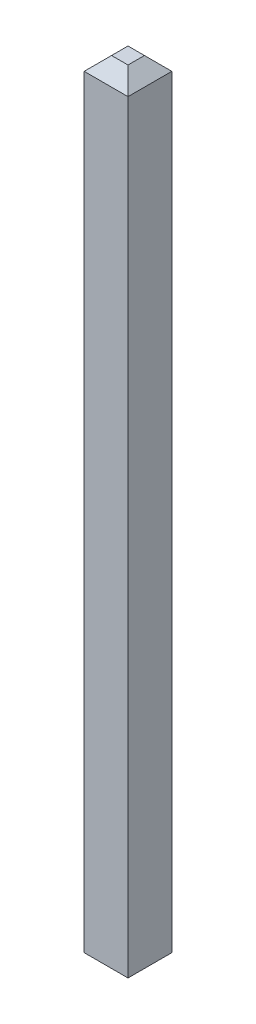
ISO-10303-21;
HEADER;
FILE_DESCRIPTION(('STEP AP214'),'2;1');
FILE_NAME('part.step','',(''),(''),'','','');
FILE_SCHEMA(('AUTOMOTIVE_DESIGN { 1 0 10303 214 1 1 1 1 }'));
ENDSEC;
DATA;
#1=APPLICATION_CONTEXT('core data for automotive mechanical design processes');
#2=APPLICATION_PROTOCOL_DEFINITION('international standard','automotive_design',2000,#1);
#3=PRODUCT_CONTEXT('',#1,'mechanical');
#4=PRODUCT('Part','Part','',(#3));
#5=PRODUCT_RELATED_PRODUCT_CATEGORY('part','',(#4));
#6=PRODUCT_DEFINITION_FORMATION('','',#4);
#7=PRODUCT_DEFINITION_CONTEXT('part definition',#1,'design');
#8=PRODUCT_DEFINITION('design','',#6,#7);
#9=PRODUCT_DEFINITION_SHAPE('','',#8);
#10=(LENGTH_UNIT() NAMED_UNIT(*) SI_UNIT(.MILLI.,.METRE.));
#11=(NAMED_UNIT(*) PLANE_ANGLE_UNIT() SI_UNIT($,.RADIAN.));
#12=(NAMED_UNIT(*) SI_UNIT($,.STERADIAN.) SOLID_ANGLE_UNIT());
#13=UNCERTAINTY_MEASURE_WITH_UNIT(LENGTH_MEASURE(1.E-05),#10,'distance_accuracy_value','');
#14=(GEOMETRIC_REPRESENTATION_CONTEXT(3) GLOBAL_UNCERTAINTY_ASSIGNED_CONTEXT((#13)) GLOBAL_UNIT_ASSIGNED_CONTEXT((#10,
#11,#12)) REPRESENTATION_CONTEXT('',''));
#15=CARTESIAN_POINT('',(0.,0.,0.));
#16=DIRECTION('',(0.,0.,1.));
#17=DIRECTION('',(1.,0.,0.));
#18=AXIS2_PLACEMENT_3D('',#15,#16,#17);
#19=CARTESIAN_POINT('',(-3.69,-4.27,-0.32));
#20=DIRECTION('',(-0.707106781186548,0.707106781186548,0.));
#21=DIRECTION('',(-0.707106781186548,-0.707106781186548,0.));
#22=AXIS2_PLACEMENT_3D('',#19,#20,#21);
#23=PLANE('',#22);
#24=DIRECTION('',(0.,0.,1.));
#25=VECTOR('',#24,1.);
#26=CARTESIAN_POINT('',(-3.48999999999999,-4.07,-0.32));
#27=LINE('',#26,#25);
#28=CARTESIAN_POINT('',(-3.49,-4.07,-0.32));
#29=VERTEX_POINT('',#28);
#30=CARTESIAN_POINT('',(-3.49,-4.07,0.32));
#31=VERTEX_POINT('',#30);
#32=EDGE_CURVE('E119',#29,#31,#27,.T.);
#33=ORIENTED_EDGE('',*,*,#32,.T.);
#34=DIRECTION('',(-0.577350269189626,-0.577350269189626,-0.577350269189626));
#35=VECTOR('',#34,1.);
#36=CARTESIAN_POINT('',(-3.49,-4.07,0.32));
#37=LINE('',#36,#35);
#38=CARTESIAN_POINT('',(-3.69,-4.27,0.12));
#39=VERTEX_POINT('',#38);
#40=EDGE_CURVE('E95',#31,#39,#37,.T.);
#41=ORIENTED_EDGE('',*,*,#40,.T.);
#42=DIRECTION('',(0.,0.,1.));
#43=VECTOR('',#42,1.);
#44=CARTESIAN_POINT('',(-3.69,-4.27,-0.32));
#45=LINE('',#44,#43);
#46=CARTESIAN_POINT('',(-3.69,-4.27,-0.12));
#47=VERTEX_POINT('',#46);
#48=EDGE_CURVE('E20',#39,#47,#45,.F.);
#49=ORIENTED_EDGE('',*,*,#48,.T.);
#50=DIRECTION('',(-0.577350269189626,-0.577350269189626,0.577350269189625));
#51=VECTOR('',#50,1.);
#52=CARTESIAN_POINT('',(-3.49,-4.07,-0.32));
#53=LINE('',#52,#51);
#54=EDGE_CURVE('E84',#29,#47,#53,.T.);
#55=ORIENTED_EDGE('',*,*,#54,.F.);
#56=EDGE_LOOP('',(#33,#41,#49,#55));
#57=FACE_BOUND('',#56,.T.);
#58=ADVANCED_FACE('F17',(#57),#23,.F.);
#59=CARTESIAN_POINT('',(-3.49,7.07,-0.32));
#60=DIRECTION('',(-0.707106781186548,-0.707106781186548,0.));
#61=DIRECTION('',(0.707106781186548,-0.707106781186548,0.));
#62=AXIS2_PLACEMENT_3D('',#59,#60,#61);
#63=PLANE('',#62);
#64=DIRECTION('',(0.,0.,1.));
#65=VECTOR('',#64,1.);
#66=CARTESIAN_POINT('',(-3.49,7.07,-0.32));
#67=LINE('',#66,#65);
#68=CARTESIAN_POINT('',(-3.49,7.07,0.32));
#69=VERTEX_POINT('',#68);
#70=CARTESIAN_POINT('',(-3.49,7.07,-0.32));
#71=VERTEX_POINT('',#70);
#72=EDGE_CURVE('E121',#69,#71,#67,.F.);
#73=ORIENTED_EDGE('',*,*,#72,.T.);
#74=DIRECTION('',(0.577350269189627,-0.577350269189627,-0.577350269189624));
#75=VECTOR('',#74,1.);
#76=CARTESIAN_POINT('',(-3.69,7.27,-0.12));
#77=LINE('',#76,#75);
#78=CARTESIAN_POINT('',(-3.69,7.27,-0.12));
#79=VERTEX_POINT('',#78);
#80=EDGE_CURVE('E78',#79,#71,#77,.T.);
#81=ORIENTED_EDGE('',*,*,#80,.F.);
#82=DIRECTION('',(0.,0.,1.));
#83=VECTOR('',#82,1.);
#84=CARTESIAN_POINT('',(-3.69,7.27,-0.32));
#85=LINE('',#84,#83);
#86=CARTESIAN_POINT('',(-3.69,7.27,0.12));
#87=VERTEX_POINT('',#86);
#88=EDGE_CURVE('E108',#79,#87,#85,.T.);
#89=ORIENTED_EDGE('',*,*,#88,.T.);
#90=DIRECTION('',(0.577350269189627,-0.577350269189627,0.577350269189624));
#91=VECTOR('',#90,1.);
#92=CARTESIAN_POINT('',(-3.69,7.27,0.119999999999999));
#93=LINE('',#92,#91);
#94=EDGE_CURVE('E116',#87,#69,#93,.T.);
#95=ORIENTED_EDGE('',*,*,#94,.T.);
#96=EDGE_LOOP('',(#73,#81,#89,#95));
#97=FACE_BOUND('',#96,.T.);
#98=ADVANCED_FACE('F214',(#97),#63,.F.);
#99=CARTESIAN_POINT('',(-3.49,-4.27,-0.32));
#100=DIRECTION('',(0.,1.,0.));
#101=DIRECTION('',(0.,0.,1.));
#102=AXIS2_PLACEMENT_3D('',#99,#100,#101);
#103=PLANE('',#102);
#104=DIRECTION('',(1.,0.,0.));
#105=VECTOR('',#104,1.);
#106=CARTESIAN_POINT('',(-3.49,-4.27,0.12));
#107=LINE('',#106,#105);
#108=CARTESIAN_POINT('',(-3.93,-4.27,0.12));
#109=VERTEX_POINT('',#108);
#110=EDGE_CURVE('E110',#39,#109,#107,.F.);
#111=ORIENTED_EDGE('',*,*,#110,.T.);
#112=DIRECTION('',(0.,0.,1.));
#113=VECTOR('',#112,1.);
#114=CARTESIAN_POINT('',(-3.93,-4.27,-0.32));
#115=LINE('',#114,#113);
#116=CARTESIAN_POINT('',(-3.93,-4.27,-0.12));
#117=VERTEX_POINT('',#116);
#118=EDGE_CURVE('E101',#109,#117,#115,.F.);
#119=ORIENTED_EDGE('',*,*,#118,.T.);
#120=DIRECTION('',(1.,0.,0.));
#121=VECTOR('',#120,1.);
#122=CARTESIAN_POINT('',(-3.81,-4.27,-0.12));
#123=LINE('',#122,#121);
#124=EDGE_CURVE('E89',#47,#117,#123,.F.);
#125=ORIENTED_EDGE('',*,*,#124,.F.);
#126=ORIENTED_EDGE('',*,*,#48,.F.);
#127=EDGE_LOOP('',(#111,#119,#125,#126));
#128=FACE_BOUND('',#127,.T.);
#129=ADVANCED_FACE('F99',(#128),#103,.F.);
#130=CARTESIAN_POINT('',(-3.81,-4.07,-0.32));
#131=DIRECTION('',(0.,-0.707106781186548,-0.707106781186548));
#132=DIRECTION('',(0.,0.707106781186548,-0.707106781186548));
#133=AXIS2_PLACEMENT_3D('',#130,#131,#132);
#134=PLANE('',#133);
#135=ORIENTED_EDGE('',*,*,#54,.T.);
#136=ORIENTED_EDGE('',*,*,#124,.T.);
#137=DIRECTION('',(-0.577350269189625,0.577350269189625,-0.577350269189627));
#138=VECTOR('',#137,1.);
#139=CARTESIAN_POINT('',(-3.93,-4.27,-0.12));
#140=LINE('',#139,#138);
#141=CARTESIAN_POINT('',(-4.13,-4.07,-0.32));
#142=VERTEX_POINT('',#141);
#143=EDGE_CURVE('E127',#117,#142,#140,.T.);
#144=ORIENTED_EDGE('',*,*,#143,.T.);
#145=DIRECTION('',(-1.,0.,0.));
#146=VECTOR('',#145,1.);
#147=CARTESIAN_POINT('',(-3.81,-4.07,-0.320000000000001));
#148=LINE('',#147,#146);
#149=EDGE_CURVE('E91',#29,#142,#148,.T.);
#150=ORIENTED_EDGE('',*,*,#149,.F.);
#151=EDGE_LOOP('',(#135,#136,#144,#150));
#152=FACE_BOUND('',#151,.T.);
#153=ADVANCED_FACE('F86',(#152),#134,.T.);
#154=CARTESIAN_POINT('',(-3.81,7.07,-0.32));
#155=DIRECTION('',(0.,0.707106781186548,-0.707106781186548));
#156=DIRECTION('',(0.,0.707106781186548,0.707106781186548));
#157=AXIS2_PLACEMENT_3D('',#154,#155,#156);
#158=PLANE('',#157);
#159=ORIENTED_EDGE('',*,*,#80,.T.);
#160=DIRECTION('',(-1.,0.,0.));
#161=VECTOR('',#160,1.);
#162=CARTESIAN_POINT('',(-3.81,7.07,-0.319999999999999));
#163=LINE('',#162,#161);
#164=CARTESIAN_POINT('',(-4.13,7.07,-0.32));
#165=VERTEX_POINT('',#164);
#166=EDGE_CURVE('E129',#165,#71,#163,.F.);
#167=ORIENTED_EDGE('',*,*,#166,.F.);
#168=DIRECTION('',(0.577350269189625,0.577350269189625,0.577350269189627));
#169=VECTOR('',#168,1.);
#170=CARTESIAN_POINT('',(-4.13,7.07,-0.32));
#171=LINE('',#170,#169);
#172=CARTESIAN_POINT('',(-3.93,7.27,-0.120000000000001));
#173=VERTEX_POINT('',#172);
#174=EDGE_CURVE('E136',#165,#173,#171,.T.);
#175=ORIENTED_EDGE('',*,*,#174,.T.);
#176=DIRECTION('',(1.,0.,0.));
#177=VECTOR('',#176,1.);
#178=CARTESIAN_POINT('',(-4.13,7.27,-0.12));
#179=LINE('',#178,#177);
#180=EDGE_CURVE('E103',#173,#79,#179,.T.);
#181=ORIENTED_EDGE('',*,*,#180,.T.);
#182=EDGE_LOOP('',(#159,#167,#175,#181));
#183=FACE_BOUND('',#182,.T.);
#184=ADVANCED_FACE('F206',(#183),#158,.T.);
#185=CARTESIAN_POINT('',(-4.13,7.27,-0.32));
#186=DIRECTION('',(0.,-1.,0.));
#187=DIRECTION('',(1.,0.,0.));
#188=AXIS2_PLACEMENT_3D('',#185,#186,#187);
#189=PLANE('',#188);
#190=ORIENTED_EDGE('',*,*,#180,.F.);
#191=DIRECTION('',(0.,0.,1.));
#192=VECTOR('',#191,1.);
#193=CARTESIAN_POINT('',(-3.93,7.27,-0.32));
#194=LINE('',#193,#192);
#195=CARTESIAN_POINT('',(-3.93,7.27,0.12));
#196=VERTEX_POINT('',#195);
#197=EDGE_CURVE('E139',#173,#196,#194,.T.);
#198=ORIENTED_EDGE('',*,*,#197,.T.);
#199=DIRECTION('',(1.,0.,0.));
#200=VECTOR('',#199,1.);
#201=CARTESIAN_POINT('',(-4.13,7.27,0.12));
#202=LINE('',#201,#200);
#203=EDGE_CURVE('E113',#196,#87,#202,.T.);
#204=ORIENTED_EDGE('',*,*,#203,.T.);
#205=ORIENTED_EDGE('',*,*,#88,.F.);
#206=EDGE_LOOP('',(#190,#198,#204,#205));
#207=FACE_BOUND('',#206,.T.);
#208=ADVANCED_FACE('F203',(#207),#189,.F.);
#209=CARTESIAN_POINT('',(-3.49,-4.27,0.12));
#210=DIRECTION('',(0.,0.707106781186548,-0.707106781186548));
#211=DIRECTION('',(0.,0.707106781186548,0.707106781186548));
#212=AXIS2_PLACEMENT_3D('',#209,#210,#211);
#213=PLANE('',#212);
#214=DIRECTION('',(-1.,0.,0.));
#215=VECTOR('',#214,1.);
#216=CARTESIAN_POINT('',(-3.81,-4.07,0.319999999999999));
#217=LINE('',#216,#215);
#218=CARTESIAN_POINT('',(-4.13,-4.07,0.32));
#219=VERTEX_POINT('',#218);
#220=EDGE_CURVE('E144',#31,#219,#217,.T.);
#221=ORIENTED_EDGE('',*,*,#220,.T.);
#222=DIRECTION('',(0.577350269189625,-0.577350269189625,-0.577350269189627));
#223=VECTOR('',#222,1.);
#224=CARTESIAN_POINT('',(-4.13,-4.07,0.32));
#225=LINE('',#224,#223);
#226=EDGE_CURVE('E123',#219,#109,#225,.T.);
#227=ORIENTED_EDGE('',*,*,#226,.T.);
#228=ORIENTED_EDGE('',*,*,#110,.F.);
#229=ORIENTED_EDGE('',*,*,#40,.F.);
#230=EDGE_LOOP('',(#221,#227,#228,#229));
#231=FACE_BOUND('',#230,.T.);
#232=ADVANCED_FACE('F176',(#231),#213,.F.);
#233=CARTESIAN_POINT('',(-4.13,7.27,0.12));
#234=DIRECTION('',(0.,-0.707106781186548,-0.707106781186548));
#235=DIRECTION('',(0.,0.707106781186548,-0.707106781186548));
#236=AXIS2_PLACEMENT_3D('',#233,#234,#235);
#237=PLANE('',#236);
#238=ORIENTED_EDGE('',*,*,#203,.F.);
#239=DIRECTION('',(-0.577350269189625,-0.577350269189625,0.577350269189627));
#240=VECTOR('',#239,1.);
#241=CARTESIAN_POINT('',(-3.93,7.27,0.12));
#242=LINE('',#241,#240);
#243=CARTESIAN_POINT('',(-4.13,7.07,0.32));
#244=VERTEX_POINT('',#243);
#245=EDGE_CURVE('E142',#196,#244,#242,.T.);
#246=ORIENTED_EDGE('',*,*,#245,.T.);
#247=DIRECTION('',(-1.,0.,0.));
#248=VECTOR('',#247,1.);
#249=CARTESIAN_POINT('',(-3.81,7.07,0.320000000000001));
#250=LINE('',#249,#248);
#251=EDGE_CURVE('E34',#244,#69,#250,.F.);
#252=ORIENTED_EDGE('',*,*,#251,.T.);
#253=ORIENTED_EDGE('',*,*,#94,.F.);
#254=EDGE_LOOP('',(#238,#246,#252,#253));
#255=FACE_BOUND('',#254,.T.);
#256=ADVANCED_FACE('F196',(#255),#237,.F.);
#257=CARTESIAN_POINT('',(-3.49,7.27,-0.32));
#258=DIRECTION('',(-1.,0.,0.));
#259=DIRECTION('',(0.,-1.,0.));
#260=AXIS2_PLACEMENT_3D('',#257,#258,#259);
#261=PLANE('',#260);
#262=ORIENTED_EDGE('',*,*,#72,.F.);
#263=DIRECTION('',(0.,1.,0.));
#264=VECTOR('',#263,1.);
#265=CARTESIAN_POINT('',(-3.49,1.5,0.32));
#266=LINE('',#265,#264);
#267=EDGE_CURVE('E148',#69,#31,#266,.F.);
#268=ORIENTED_EDGE('',*,*,#267,.T.);
#269=ORIENTED_EDGE('',*,*,#32,.F.);
#270=DIRECTION('',(0.,1.,0.));
#271=VECTOR('',#270,1.);
#272=CARTESIAN_POINT('',(-3.49,1.5,-0.32));
#273=LINE('',#272,#271);
#274=EDGE_CURVE('E132',#71,#29,#273,.F.);
#275=ORIENTED_EDGE('',*,*,#274,.F.);
#276=EDGE_LOOP('',(#262,#268,#269,#275));
#277=FACE_BOUND('',#276,.T.);
#278=ADVANCED_FACE('F193',(#277),#261,.F.);
#279=CARTESIAN_POINT('',(-4.13,-4.07,-0.32));
#280=DIRECTION('',(0.707106781186548,0.707106781186548,0.));
#281=DIRECTION('',(-0.707106781186548,0.707106781186548,0.));
#282=AXIS2_PLACEMENT_3D('',#279,#280,#281);
#283=PLANE('',#282);
#284=ORIENTED_EDGE('',*,*,#118,.F.);
#285=ORIENTED_EDGE('',*,*,#226,.F.);
#286=DIRECTION('',(0.,0.,-1.));
#287=VECTOR('',#286,1.);
#288=CARTESIAN_POINT('',(-4.13,-4.07,-0.32));
#289=LINE('',#288,#287);
#290=EDGE_CURVE('E151',#219,#142,#289,.T.);
#291=ORIENTED_EDGE('',*,*,#290,.T.);
#292=ORIENTED_EDGE('',*,*,#143,.F.);
#293=EDGE_LOOP('',(#284,#285,#291,#292));
#294=FACE_BOUND('',#293,.T.);
#295=ADVANCED_FACE('F173',(#294),#283,.F.);
#296=CARTESIAN_POINT('',(-3.81,1.5,-0.32));
#297=DIRECTION('',(0.,0.,-1.));
#298=DIRECTION('',(-1.,0.,0.));
#299=AXIS2_PLACEMENT_3D('',#296,#297,#298);
#300=PLANE('',#299);
#301=ORIENTED_EDGE('',*,*,#274,.T.);
#302=ORIENTED_EDGE('',*,*,#149,.T.);
#303=DIRECTION('',(0.,1.,0.));
#304=VECTOR('',#303,1.);
#305=CARTESIAN_POINT('',(-4.13,-4.27,-0.32));
#306=LINE('',#305,#304);
#307=EDGE_CURVE('E154',#142,#165,#306,.T.);
#308=ORIENTED_EDGE('',*,*,#307,.T.);
#309=ORIENTED_EDGE('',*,*,#166,.T.);
#310=EDGE_LOOP('',(#301,#302,#308,#309));
#311=FACE_BOUND('',#310,.T.);
#312=ADVANCED_FACE('F170',(#311),#300,.T.);
#313=CARTESIAN_POINT('',(-3.93,7.27,-0.32));
#314=DIRECTION('',(0.707106781186548,-0.707106781186548,0.));
#315=DIRECTION('',(0.707106781186548,0.707106781186548,0.));
#316=AXIS2_PLACEMENT_3D('',#313,#314,#315);
#317=PLANE('',#316);
#318=ORIENTED_EDGE('',*,*,#197,.F.);
#319=ORIENTED_EDGE('',*,*,#174,.F.);
#320=DIRECTION('',(0.,0.,-1.));
#321=VECTOR('',#320,1.);
#322=CARTESIAN_POINT('',(-4.13,7.07,-0.32));
#323=LINE('',#322,#321);
#324=EDGE_CURVE('E26',#165,#244,#323,.F.);
#325=ORIENTED_EDGE('',*,*,#324,.T.);
#326=ORIENTED_EDGE('',*,*,#245,.F.);
#327=EDGE_LOOP('',(#318,#319,#325,#326));
#328=FACE_BOUND('',#327,.T.);
#329=ADVANCED_FACE('F162',(#328),#317,.F.);
#330=CARTESIAN_POINT('',(-3.81,1.5,0.32));
#331=DIRECTION('',(0.,0.,-1.));
#332=DIRECTION('',(-1.,0.,0.));
#333=AXIS2_PLACEMENT_3D('',#330,#331,#332);
#334=PLANE('',#333);
#335=ORIENTED_EDGE('',*,*,#251,.F.);
#336=DIRECTION('',(0.,1.,0.));
#337=VECTOR('',#336,1.);
#338=CARTESIAN_POINT('',(-4.13,-4.27,0.32));
#339=LINE('',#338,#337);
#340=EDGE_CURVE('E11',#244,#219,#339,.F.);
#341=ORIENTED_EDGE('',*,*,#340,.T.);
#342=ORIENTED_EDGE('',*,*,#220,.F.);
#343=ORIENTED_EDGE('',*,*,#267,.F.);
#344=EDGE_LOOP('',(#335,#341,#342,#343));
#345=FACE_BOUND('',#344,.T.);
#346=ADVANCED_FACE('F177',(#345),#334,.F.);
#347=CARTESIAN_POINT('',(-4.13,-4.27,-0.32));
#348=DIRECTION('',(1.,0.,0.));
#349=DIRECTION('',(0.,0.,-1.));
#350=AXIS2_PLACEMENT_3D('',#347,#348,#349);
#351=PLANE('',#350);
#352=ORIENTED_EDGE('',*,*,#324,.F.);
#353=ORIENTED_EDGE('',*,*,#307,.F.);
#354=ORIENTED_EDGE('',*,*,#290,.F.);
#355=ORIENTED_EDGE('',*,*,#340,.F.);
#356=EDGE_LOOP('',(#352,#353,#354,#355));
#357=FACE_BOUND('',#356,.T.);
#358=ADVANCED_FACE('F167',(#357),#351,.F.);
#359=CLOSED_SHELL('',(#58,#98,#129,#153,#184,#208,#232,#256,#278,#295,#312,#329,#346,#358));
#360=MANIFOLD_SOLID_BREP('B1',#359);
#361=ADVANCED_BREP_SHAPE_REPRESENTATION('',(#18,#360),#14);
#362=SHAPE_DEFINITION_REPRESENTATION(#9,#361);
ENDSEC;
END-ISO-10303-21;
